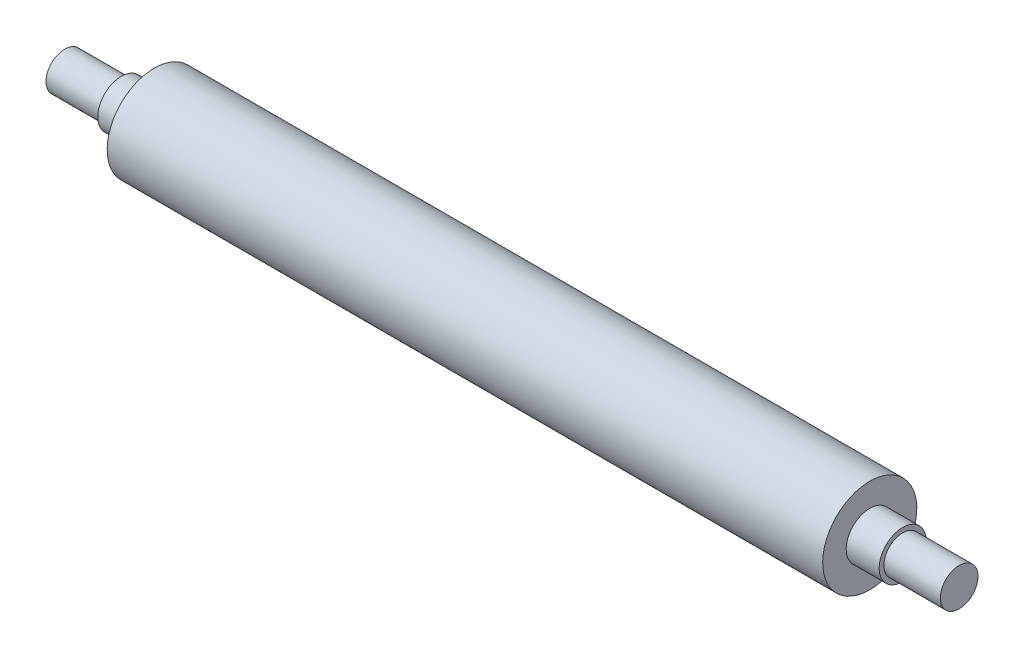
ISO-10303-21;
HEADER;
FILE_DESCRIPTION(('STEP AP214'),'2;1');
FILE_NAME('part.step','',(''),(''),'','','');
FILE_SCHEMA(('AUTOMOTIVE_DESIGN { 1 0 10303 214 1 1 1 1 }'));
ENDSEC;
DATA;
#1=APPLICATION_CONTEXT('core data for automotive mechanical design processes');
#2=APPLICATION_PROTOCOL_DEFINITION('international standard','automotive_design',2000,#1);
#3=PRODUCT_CONTEXT('',#1,'mechanical');
#4=PRODUCT('Part','Part','',(#3));
#5=PRODUCT_RELATED_PRODUCT_CATEGORY('part','',(#4));
#6=PRODUCT_DEFINITION_FORMATION('','',#4);
#7=PRODUCT_DEFINITION_CONTEXT('part definition',#1,'design');
#8=PRODUCT_DEFINITION('design','',#6,#7);
#9=PRODUCT_DEFINITION_SHAPE('','',#8);
#10=(LENGTH_UNIT() NAMED_UNIT(*) SI_UNIT(.MILLI.,.METRE.));
#11=(NAMED_UNIT(*) PLANE_ANGLE_UNIT() SI_UNIT($,.RADIAN.));
#12=(NAMED_UNIT(*) SI_UNIT($,.STERADIAN.) SOLID_ANGLE_UNIT());
#13=UNCERTAINTY_MEASURE_WITH_UNIT(LENGTH_MEASURE(1.E-05),#10,'distance_accuracy_value','');
#14=(GEOMETRIC_REPRESENTATION_CONTEXT(3) GLOBAL_UNCERTAINTY_ASSIGNED_CONTEXT((#13)) GLOBAL_UNIT_ASSIGNED_CONTEXT((#10,
#11,#12)) REPRESENTATION_CONTEXT('',''));
#15=CARTESIAN_POINT('',(0.,0.,0.));
#16=DIRECTION('',(0.,0.,1.));
#17=DIRECTION('',(1.,0.,0.));
#18=AXIS2_PLACEMENT_3D('',#15,#16,#17);
#19=CARTESIAN_POINT('',(-237.5,0.,0.));
#20=DIRECTION('',(-1.,0.,0.));
#21=DIRECTION('',(0.,-1.,0.));
#22=AXIS2_PLACEMENT_3D('',#19,#20,#21);
#23=CYLINDRICAL_SURFACE('',#22,9.99999999999999);
#24=CARTESIAN_POINT('',(207.5,0.,0.));
#25=DIRECTION('',(-1.,0.,0.));
#26=DIRECTION('',(0.,-1.,0.));
#27=AXIS2_PLACEMENT_3D('',#24,#25,#26);
#28=CIRCLE('',#27,9.99999999999999);
#29=CARTESIAN_POINT('',(207.5,-9.99999999999994,0.));
#30=VERTEX_POINT('',#29);
#31=EDGE_CURVE('E80',#30,#30,#28,.T.);
#32=ORIENTED_EDGE('',*,*,#31,.F.);
#33=EDGE_LOOP('',(#32));
#34=FACE_BOUND('',#33,.T.);
#35=CARTESIAN_POINT('',(237.5,0.,0.));
#36=DIRECTION('',(-1.,0.,0.));
#37=DIRECTION('',(0.,-1.,0.));
#38=AXIS2_PLACEMENT_3D('',#35,#36,#37);
#39=CIRCLE('',#38,9.99999999999999);
#40=CARTESIAN_POINT('',(237.5,-9.99999999999993,0.));
#41=VERTEX_POINT('',#40);
#42=EDGE_CURVE('E10',#41,#41,#39,.T.);
#43=ORIENTED_EDGE('',*,*,#42,.T.);
#44=EDGE_LOOP('',(#43));
#45=FACE_BOUND('',#44,.T.);
#46=ADVANCED_FACE('F37',(#34,#45),#23,.T.);
#47=CARTESIAN_POINT('',(237.5,10.,0.));
#48=DIRECTION('',(-1.,0.,0.));
#49=DIRECTION('',(0.,-1.,0.));
#50=AXIS2_PLACEMENT_3D('',#47,#48,#49);
#51=PLANE('',#50);
#52=ORIENTED_EDGE('',*,*,#42,.F.);
#53=EDGE_LOOP('',(#52));
#54=FACE_BOUND('',#53,.T.);
#55=ADVANCED_FACE('F88',(#54),#51,.F.);
#56=CARTESIAN_POINT('',(-237.5,9.99999999999999,0.));
#57=DIRECTION('',(1.,0.,0.));
#58=DIRECTION('',(0.,1.,0.));
#59=AXIS2_PLACEMENT_3D('',#56,#57,#58);
#60=PLANE('',#59);
#61=CARTESIAN_POINT('',(-237.5,0.,0.));
#62=DIRECTION('',(-1.,0.,0.));
#63=DIRECTION('',(0.,-1.,0.));
#64=AXIS2_PLACEMENT_3D('',#61,#62,#63);
#65=CIRCLE('',#64,9.99999999999999);
#66=CARTESIAN_POINT('',(-237.5,-9.99999999999999,0.));
#67=VERTEX_POINT('',#66);
#68=EDGE_CURVE('E44',#67,#67,#65,.T.);
#69=ORIENTED_EDGE('',*,*,#68,.T.);
#70=EDGE_LOOP('',(#69));
#71=FACE_BOUND('',#70,.T.);
#72=ADVANCED_FACE('F92',(#71),#60,.F.);
#73=CARTESIAN_POINT('',(-237.5,0.,0.));
#74=DIRECTION('',(-1.,0.,0.));
#75=DIRECTION('',(0.,-1.,0.));
#76=AXIS2_PLACEMENT_3D('',#73,#74,#75);
#77=CYLINDRICAL_SURFACE('',#76,9.99999999999999);
#78=ORIENTED_EDGE('',*,*,#68,.F.);
#79=EDGE_LOOP('',(#78));
#80=FACE_BOUND('',#79,.T.);
#81=CARTESIAN_POINT('',(-207.5,0.,0.));
#82=DIRECTION('',(-1.,0.,0.));
#83=DIRECTION('',(0.,-1.,0.));
#84=AXIS2_PLACEMENT_3D('',#81,#82,#83);
#85=CIRCLE('',#84,9.99999999999999);
#86=CARTESIAN_POINT('',(-207.5,-9.99999999999999,0.));
#87=VERTEX_POINT('',#86);
#88=EDGE_CURVE('E49',#87,#87,#85,.T.);
#89=ORIENTED_EDGE('',*,*,#88,.T.);
#90=EDGE_LOOP('',(#89));
#91=FACE_BOUND('',#90,.T.);
#92=ADVANCED_FACE('F97',(#80,#91),#77,.T.);
#93=CARTESIAN_POINT('',(-207.5,10.,0.));
#94=DIRECTION('',(1.,0.,0.));
#95=DIRECTION('',(0.,1.,0.));
#96=AXIS2_PLACEMENT_3D('',#93,#94,#95);
#97=PLANE('',#96);
#98=ORIENTED_EDGE('',*,*,#88,.F.);
#99=EDGE_LOOP('',(#98));
#100=FACE_BOUND('',#99,.T.);
#101=CARTESIAN_POINT('',(-207.5,0.,0.));
#102=DIRECTION('',(-1.,0.,0.));
#103=DIRECTION('',(0.,-1.,0.));
#104=AXIS2_PLACEMENT_3D('',#101,#102,#103);
#105=CIRCLE('',#104,12.5);
#106=CARTESIAN_POINT('',(-207.5,-12.5,0.));
#107=VERTEX_POINT('',#106);
#108=EDGE_CURVE('E54',#107,#107,#105,.T.);
#109=ORIENTED_EDGE('',*,*,#108,.T.);
#110=EDGE_LOOP('',(#109));
#111=FACE_BOUND('',#110,.T.);
#112=ADVANCED_FACE('F102',(#100,#111),#97,.F.);
#113=CARTESIAN_POINT('',(-237.5,0.,0.));
#114=DIRECTION('',(-1.,0.,0.));
#115=DIRECTION('',(0.,-1.,0.));
#116=AXIS2_PLACEMENT_3D('',#113,#114,#115);
#117=CYLINDRICAL_SURFACE('',#116,12.5);
#118=ORIENTED_EDGE('',*,*,#108,.F.);
#119=EDGE_LOOP('',(#118));
#120=FACE_BOUND('',#119,.T.);
#121=CARTESIAN_POINT('',(-190.,0.,0.));
#122=DIRECTION('',(-1.,0.,0.));
#123=DIRECTION('',(0.,-1.,0.));
#124=AXIS2_PLACEMENT_3D('',#121,#122,#123);
#125=CIRCLE('',#124,12.5);
#126=CARTESIAN_POINT('',(-190.,-12.5,0.));
#127=VERTEX_POINT('',#126);
#128=EDGE_CURVE('E60',#127,#127,#125,.T.);
#129=ORIENTED_EDGE('',*,*,#128,.T.);
#130=EDGE_LOOP('',(#129));
#131=FACE_BOUND('',#130,.T.);
#132=ADVANCED_FACE('F106',(#120,#131),#117,.T.);
#133=CARTESIAN_POINT('',(-190.,25.,0.));
#134=DIRECTION('',(1.,0.,0.));
#135=DIRECTION('',(0.,1.,0.));
#136=AXIS2_PLACEMENT_3D('',#133,#134,#135);
#137=PLANE('',#136);
#138=ORIENTED_EDGE('',*,*,#128,.F.);
#139=EDGE_LOOP('',(#138));
#140=FACE_BOUND('',#139,.T.);
#141=CARTESIAN_POINT('',(-190.,0.,0.));
#142=DIRECTION('',(-1.,0.,0.));
#143=DIRECTION('',(0.,-1.,0.));
#144=AXIS2_PLACEMENT_3D('',#141,#142,#143);
#145=CIRCLE('',#144,25.);
#146=CARTESIAN_POINT('',(-190.,-24.9999999999999,0.));
#147=VERTEX_POINT('',#146);
#148=EDGE_CURVE('E64',#147,#147,#145,.T.);
#149=ORIENTED_EDGE('',*,*,#148,.T.);
#150=EDGE_LOOP('',(#149));
#151=FACE_BOUND('',#150,.T.);
#152=ADVANCED_FACE('F110',(#140,#151),#137,.F.);
#153=CARTESIAN_POINT('',(-237.5,0.,0.));
#154=DIRECTION('',(-1.,0.,0.));
#155=DIRECTION('',(0.,-1.,0.));
#156=AXIS2_PLACEMENT_3D('',#153,#154,#155);
#157=CYLINDRICAL_SURFACE('',#156,25.);
#158=ORIENTED_EDGE('',*,*,#148,.F.);
#159=EDGE_LOOP('',(#158));
#160=FACE_BOUND('',#159,.T.);
#161=CARTESIAN_POINT('',(190.,0.,0.));
#162=DIRECTION('',(-1.,0.,0.));
#163=DIRECTION('',(0.,-1.,0.));
#164=AXIS2_PLACEMENT_3D('',#161,#162,#163);
#165=CIRCLE('',#164,25.);
#166=CARTESIAN_POINT('',(190.,-24.9999999999999,0.));
#167=VERTEX_POINT('',#166);
#168=EDGE_CURVE('E68',#167,#167,#165,.T.);
#169=ORIENTED_EDGE('',*,*,#168,.T.);
#170=EDGE_LOOP('',(#169));
#171=FACE_BOUND('',#170,.T.);
#172=ADVANCED_FACE('F114',(#160,#171),#157,.T.);
#173=CARTESIAN_POINT('',(190.,25.,0.));
#174=DIRECTION('',(-1.,0.,0.));
#175=DIRECTION('',(0.,-1.,0.));
#176=AXIS2_PLACEMENT_3D('',#173,#174,#175);
#177=PLANE('',#176);
#178=ORIENTED_EDGE('',*,*,#168,.F.);
#179=EDGE_LOOP('',(#178));
#180=FACE_BOUND('',#179,.T.);
#181=CARTESIAN_POINT('',(190.,0.,0.));
#182=DIRECTION('',(-1.,0.,0.));
#183=DIRECTION('',(0.,-1.,0.));
#184=AXIS2_PLACEMENT_3D('',#181,#182,#183);
#185=CIRCLE('',#184,12.5);
#186=CARTESIAN_POINT('',(190.,-12.4999999999999,0.));
#187=VERTEX_POINT('',#186);
#188=EDGE_CURVE('E72',#187,#187,#185,.T.);
#189=ORIENTED_EDGE('',*,*,#188,.T.);
#190=EDGE_LOOP('',(#189));
#191=FACE_BOUND('',#190,.T.);
#192=ADVANCED_FACE('F118',(#180,#191),#177,.F.);
#193=CARTESIAN_POINT('',(-237.5,0.,0.));
#194=DIRECTION('',(-1.,0.,0.));
#195=DIRECTION('',(0.,-1.,0.));
#196=AXIS2_PLACEMENT_3D('',#193,#194,#195);
#197=CYLINDRICAL_SURFACE('',#196,12.5);
#198=ORIENTED_EDGE('',*,*,#188,.F.);
#199=EDGE_LOOP('',(#198));
#200=FACE_BOUND('',#199,.T.);
#201=CARTESIAN_POINT('',(207.5,0.,0.));
#202=DIRECTION('',(-1.,0.,0.));
#203=DIRECTION('',(0.,-1.,0.));
#204=AXIS2_PLACEMENT_3D('',#201,#202,#203);
#205=CIRCLE('',#204,12.5);
#206=CARTESIAN_POINT('',(207.5,-12.4999999999999,0.));
#207=VERTEX_POINT('',#206);
#208=EDGE_CURVE('E76',#207,#207,#205,.T.);
#209=ORIENTED_EDGE('',*,*,#208,.T.);
#210=EDGE_LOOP('',(#209));
#211=FACE_BOUND('',#210,.T.);
#212=ADVANCED_FACE('F122',(#200,#211),#197,.T.);
#213=CARTESIAN_POINT('',(207.5,10.,0.));
#214=DIRECTION('',(-1.,0.,0.));
#215=DIRECTION('',(0.,-1.,0.));
#216=AXIS2_PLACEMENT_3D('',#213,#214,#215);
#217=PLANE('',#216);
#218=ORIENTED_EDGE('',*,*,#208,.F.);
#219=EDGE_LOOP('',(#218));
#220=FACE_BOUND('',#219,.T.);
#221=ORIENTED_EDGE('',*,*,#31,.T.);
#222=EDGE_LOOP('',(#221));
#223=FACE_BOUND('',#222,.T.);
#224=ADVANCED_FACE('F85',(#220,#223),#217,.F.);
#225=CLOSED_SHELL('',(#46,#55,#72,#92,#112,#132,#152,#172,#192,#212,#224));
#226=MANIFOLD_SOLID_BREP('B2',#225);
#227=ADVANCED_BREP_SHAPE_REPRESENTATION('',(#18,#226),#14);
#228=SHAPE_DEFINITION_REPRESENTATION(#9,#227);
ENDSEC;
END-ISO-10303-21;
